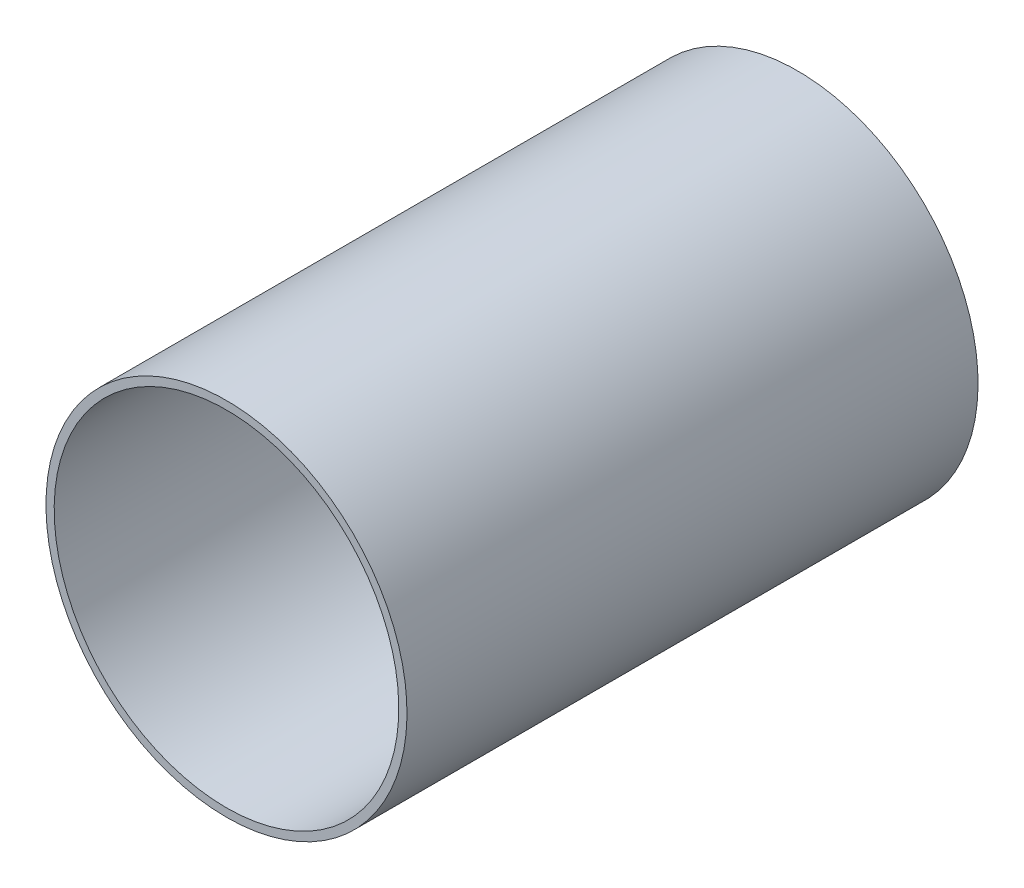
ISO-10303-21;
HEADER;
FILE_DESCRIPTION(('STEP AP214'),'2;1');
FILE_NAME('part.step','',(''),(''),'','','');
FILE_SCHEMA(('AUTOMOTIVE_DESIGN { 1 0 10303 214 1 1 1 1 }'));
ENDSEC;
DATA;
#1=APPLICATION_CONTEXT('core data for automotive mechanical design processes');
#2=APPLICATION_PROTOCOL_DEFINITION('international standard','automotive_design',2000,#1);
#3=PRODUCT_CONTEXT('',#1,'mechanical');
#4=PRODUCT('Part','Part','',(#3));
#5=PRODUCT_RELATED_PRODUCT_CATEGORY('part','',(#4));
#6=PRODUCT_DEFINITION_FORMATION('','',#4);
#7=PRODUCT_DEFINITION_CONTEXT('part definition',#1,'design');
#8=PRODUCT_DEFINITION('design','',#6,#7);
#9=PRODUCT_DEFINITION_SHAPE('','',#8);
#10=(LENGTH_UNIT() NAMED_UNIT(*) SI_UNIT(.MILLI.,.METRE.));
#11=(NAMED_UNIT(*) PLANE_ANGLE_UNIT() SI_UNIT($,.RADIAN.));
#12=(NAMED_UNIT(*) SI_UNIT($,.STERADIAN.) SOLID_ANGLE_UNIT());
#13=UNCERTAINTY_MEASURE_WITH_UNIT(LENGTH_MEASURE(1.E-05),#10,'distance_accuracy_value','');
#14=(GEOMETRIC_REPRESENTATION_CONTEXT(3) GLOBAL_UNCERTAINTY_ASSIGNED_CONTEXT((#13)) GLOBAL_UNIT_ASSIGNED_CONTEXT((#10,
#11,#12)) REPRESENTATION_CONTEXT('',''));
#15=CARTESIAN_POINT('',(0.,0.,0.));
#16=DIRECTION('',(0.,0.,1.));
#17=DIRECTION('',(1.,0.,0.));
#18=AXIS2_PLACEMENT_3D('',#15,#16,#17);
#19=CARTESIAN_POINT('',(154.002,-113.984,-0.045));
#20=DIRECTION('',(0.,0.,-1.));
#21=DIRECTION('',(0.,-1.,0.));
#22=AXIS2_PLACEMENT_3D('',#19,#20,#21);
#23=CYLINDRICAL_SURFACE('',#22,0.525);
#24=CARTESIAN_POINT('',(154.002,-113.984,-0.035));
#25=DIRECTION('',(0.,0.,-1.));
#26=DIRECTION('',(0.,-1.,0.));
#27=AXIS2_PLACEMENT_3D('',#24,#25,#26);
#28=CIRCLE('',#27,0.525);
#29=CARTESIAN_POINT('',(154.002,-114.509,-0.035));
#30=VERTEX_POINT('',#29);
#31=EDGE_CURVE('E64',#30,#30,#28,.T.);
#32=ORIENTED_EDGE('',*,*,#31,.T.);
#33=DIRECTION('',(0.,0.,1.));
#34=VECTOR('',#33,1.);
#35=CARTESIAN_POINT('',(154.002,-114.509,-0.045));
#36=LINE('',#35,#34);
#37=CARTESIAN_POINT('',(154.002,-114.509,1.705));
#38=VERTEX_POINT('',#37);
#39=EDGE_CURVE('E11',#30,#38,#36,.T.);
#40=ORIENTED_EDGE('',*,*,#39,.T.);
#41=CARTESIAN_POINT('',(154.002,-113.984,1.705));
#42=DIRECTION('',(0.,0.,-1.));
#43=DIRECTION('',(0.,-1.,0.));
#44=AXIS2_PLACEMENT_3D('',#41,#42,#43);
#45=CIRCLE('',#44,0.525);
#46=EDGE_CURVE('E25',#38,#38,#45,.T.);
#47=ORIENTED_EDGE('',*,*,#46,.F.);
#48=ORIENTED_EDGE('',*,*,#39,.F.);
#49=EDGE_LOOP('',(#32,#40,#47,#48));
#50=FACE_BOUND('',#49,.T.);
#51=ADVANCED_FACE('F17',(#50),#23,.F.);
#52=CARTESIAN_POINT('',(154.002,-114.534,1.705));
#53=DIRECTION('',(0.,0.,1.));
#54=DIRECTION('',(1.,0.,0.));
#55=AXIS2_PLACEMENT_3D('',#52,#53,#54);
#56=PLANE('',#55);
#57=ORIENTED_EDGE('',*,*,#46,.T.);
#58=EDGE_LOOP('',(#57));
#59=FACE_BOUND('',#58,.T.);
#60=CARTESIAN_POINT('',(154.002,-113.984,1.705));
#61=DIRECTION('',(0.,0.,1.));
#62=DIRECTION('',(0.,-1.,0.));
#63=AXIS2_PLACEMENT_3D('',#60,#61,#62);
#64=CIRCLE('',#63,0.55);
#65=CARTESIAN_POINT('',(154.002,-114.534,1.705));
#66=VERTEX_POINT('',#65);
#67=EDGE_CURVE('E56',#66,#66,#64,.T.);
#68=ORIENTED_EDGE('',*,*,#67,.T.);
#69=EDGE_LOOP('',(#68));
#70=FACE_BOUND('',#69,.T.);
#71=ADVANCED_FACE('F76',(#59,#70),#56,.T.);
#72=CARTESIAN_POINT('',(154.002,-114.534,-0.035));
#73=DIRECTION('',(0.,0.,1.));
#74=DIRECTION('',(1.,0.,0.));
#75=AXIS2_PLACEMENT_3D('',#72,#73,#74);
#76=PLANE('',#75);
#77=ORIENTED_EDGE('',*,*,#31,.F.);
#78=EDGE_LOOP('',(#77));
#79=FACE_BOUND('',#78,.T.);
#80=CARTESIAN_POINT('',(154.002,-113.984,-0.035));
#81=DIRECTION('',(0.,0.,1.));
#82=DIRECTION('',(0.,-1.,0.));
#83=AXIS2_PLACEMENT_3D('',#80,#81,#82);
#84=CIRCLE('',#83,0.55);
#85=CARTESIAN_POINT('',(154.002,-114.534,-0.035));
#86=VERTEX_POINT('',#85);
#87=EDGE_CURVE('E55',#86,#86,#84,.T.);
#88=ORIENTED_EDGE('',*,*,#87,.F.);
#89=EDGE_LOOP('',(#88));
#90=FACE_BOUND('',#89,.T.);
#91=ADVANCED_FACE('F84',(#79,#90),#76,.F.);
#92=CARTESIAN_POINT('',(154.002,-113.984,-0.035));
#93=DIRECTION('',(0.,0.,-1.));
#94=DIRECTION('',(0.,-1.,0.));
#95=AXIS2_PLACEMENT_3D('',#92,#93,#94);
#96=CYLINDRICAL_SURFACE('',#95,0.55);
#97=ORIENTED_EDGE('',*,*,#87,.T.);
#98=DIRECTION('',(0.,0.,1.));
#99=VECTOR('',#98,1.);
#100=CARTESIAN_POINT('',(154.002,-114.534,-0.035));
#101=LINE('',#100,#99);
#102=EDGE_CURVE('E52',#86,#66,#101,.T.);
#103=ORIENTED_EDGE('',*,*,#102,.T.);
#104=ORIENTED_EDGE('',*,*,#67,.F.);
#105=ORIENTED_EDGE('',*,*,#102,.F.);
#106=EDGE_LOOP('',(#97,#103,#104,#105));
#107=FACE_BOUND('',#106,.T.);
#108=ADVANCED_FACE('F53',(#107),#96,.T.);
#109=CLOSED_SHELL('',(#51,#71,#91,#108));
#110=MANIFOLD_SOLID_BREP('B1',#109);
#111=ADVANCED_BREP_SHAPE_REPRESENTATION('',(#18,#110),#14);
#112=SHAPE_DEFINITION_REPRESENTATION(#9,#111);
ENDSEC;
END-ISO-10303-21;
